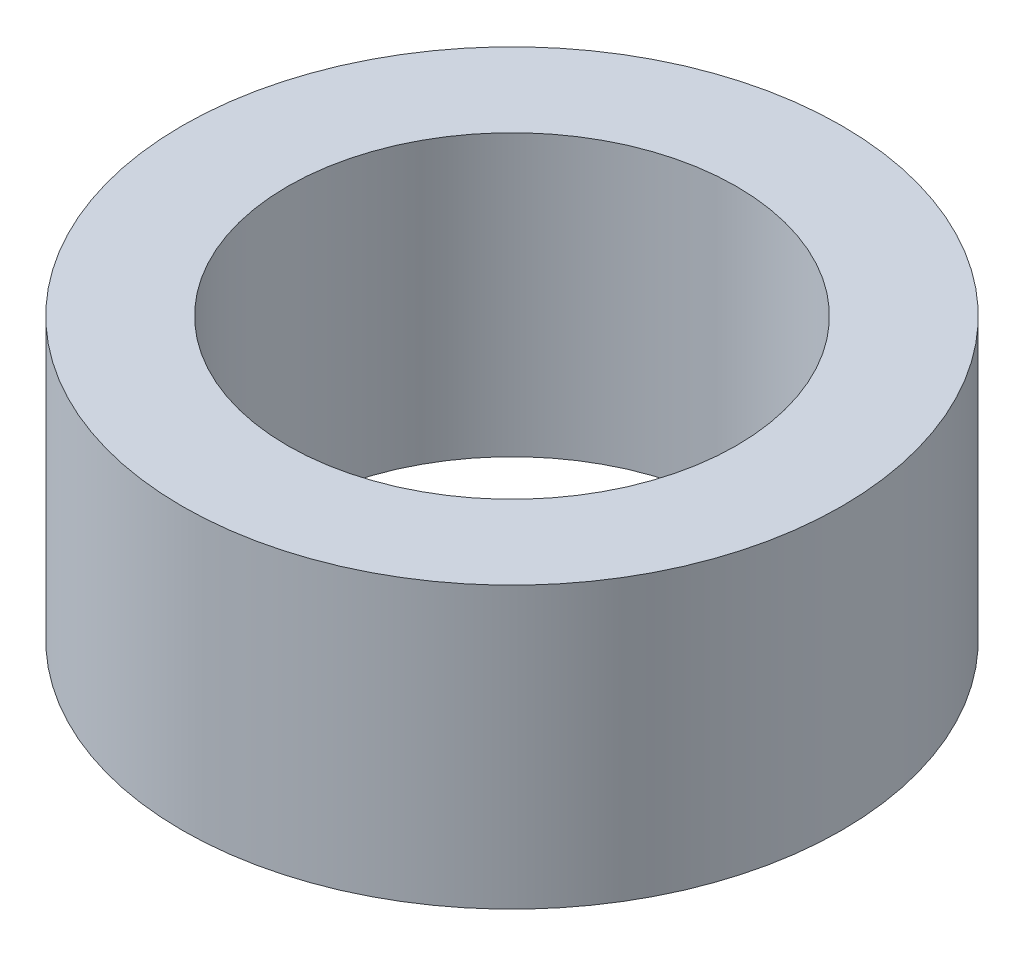
ISO-10303-21;
HEADER;
FILE_DESCRIPTION(('STEP AP214'),'2;1');
FILE_NAME('part.step','',(''),(''),'','','');
FILE_SCHEMA(('AUTOMOTIVE_DESIGN { 1 0 10303 214 1 1 1 1 }'));
ENDSEC;
DATA;
#1=APPLICATION_CONTEXT('core data for automotive mechanical design processes');
#2=APPLICATION_PROTOCOL_DEFINITION('international standard','automotive_design',2000,#1);
#3=PRODUCT_CONTEXT('',#1,'mechanical');
#4=PRODUCT('Part','Part','',(#3));
#5=PRODUCT_RELATED_PRODUCT_CATEGORY('part','',(#4));
#6=PRODUCT_DEFINITION_FORMATION('','',#4);
#7=PRODUCT_DEFINITION_CONTEXT('part definition',#1,'design');
#8=PRODUCT_DEFINITION('design','',#6,#7);
#9=PRODUCT_DEFINITION_SHAPE('','',#8);
#10=(LENGTH_UNIT() NAMED_UNIT(*) SI_UNIT(.MILLI.,.METRE.));
#11=(NAMED_UNIT(*) PLANE_ANGLE_UNIT() SI_UNIT($,.RADIAN.));
#12=(NAMED_UNIT(*) SI_UNIT($,.STERADIAN.) SOLID_ANGLE_UNIT());
#13=UNCERTAINTY_MEASURE_WITH_UNIT(LENGTH_MEASURE(1.E-05),#10,'distance_accuracy_value','');
#14=(GEOMETRIC_REPRESENTATION_CONTEXT(3) GLOBAL_UNCERTAINTY_ASSIGNED_CONTEXT((#13)) GLOBAL_UNIT_ASSIGNED_CONTEXT((#10,
#11,#12)) REPRESENTATION_CONTEXT('',''));
#15=CARTESIAN_POINT('',(0.,0.,0.));
#16=DIRECTION('',(0.,0.,1.));
#17=DIRECTION('',(1.,0.,0.));
#18=AXIS2_PLACEMENT_3D('',#15,#16,#17);
#19=CARTESIAN_POINT('',(0.,2.,0.));
#20=DIRECTION('',(0.,1.,0.));
#21=DIRECTION('',(0.,0.,1.));
#22=AXIS2_PLACEMENT_3D('',#19,#20,#21);
#23=PLANE('',#22);
#24=CARTESIAN_POINT('',(0.,2.,0.));
#25=DIRECTION('',(0.,1.,0.));
#26=DIRECTION('',(0.,0.,1.));
#27=AXIS2_PLACEMENT_3D('',#24,#25,#26);
#28=CIRCLE('',#27,2.35);
#29=CARTESIAN_POINT('',(0.,2.,2.35));
#30=VERTEX_POINT('',#29);
#31=EDGE_CURVE('E10',#30,#30,#28,.T.);
#32=ORIENTED_EDGE('',*,*,#31,.T.);
#33=EDGE_LOOP('',(#32));
#34=FACE_BOUND('',#33,.T.);
#35=CARTESIAN_POINT('',(0.,2.,0.));
#36=DIRECTION('',(0.,1.,0.));
#37=DIRECTION('',(0.,0.,1.));
#38=AXIS2_PLACEMENT_3D('',#35,#36,#37);
#39=CIRCLE('',#38,1.6);
#40=CARTESIAN_POINT('',(0.,2.,1.6));
#41=VERTEX_POINT('',#40);
#42=EDGE_CURVE('E50',#41,#41,#39,.T.);
#43=ORIENTED_EDGE('',*,*,#42,.F.);
#44=EDGE_LOOP('',(#43));
#45=FACE_BOUND('',#44,.T.);
#46=ADVANCED_FACE('F37',(#34,#45),#23,.T.);
#47=CARTESIAN_POINT('',(0.,0.,0.));
#48=DIRECTION('',(0.,1.,0.));
#49=DIRECTION('',(0.,0.,1.));
#50=AXIS2_PLACEMENT_3D('',#47,#48,#49);
#51=PLANE('',#50);
#52=CARTESIAN_POINT('',(0.,0.,0.));
#53=DIRECTION('',(0.,1.,0.));
#54=DIRECTION('',(0.,0.,1.));
#55=AXIS2_PLACEMENT_3D('',#52,#53,#54);
#56=CIRCLE('',#55,2.35);
#57=CARTESIAN_POINT('',(0.,0.,2.35));
#58=VERTEX_POINT('',#57);
#59=EDGE_CURVE('E41',#58,#58,#56,.T.);
#60=ORIENTED_EDGE('',*,*,#59,.F.);
#61=EDGE_LOOP('',(#60));
#62=FACE_BOUND('',#61,.T.);
#63=CARTESIAN_POINT('',(0.,0.,0.));
#64=DIRECTION('',(0.,1.,0.));
#65=DIRECTION('',(0.,0.,1.));
#66=AXIS2_PLACEMENT_3D('',#63,#64,#65);
#67=CIRCLE('',#66,1.6);
#68=CARTESIAN_POINT('',(0.,0.,1.6));
#69=VERTEX_POINT('',#68);
#70=EDGE_CURVE('E52',#69,#69,#67,.T.);
#71=ORIENTED_EDGE('',*,*,#70,.T.);
#72=EDGE_LOOP('',(#71));
#73=FACE_BOUND('',#72,.T.);
#74=ADVANCED_FACE('F64',(#62,#73),#51,.F.);
#75=CARTESIAN_POINT('',(0.,2.,0.));
#76=DIRECTION('',(0.,-1.,0.));
#77=DIRECTION('',(0.,0.,-1.));
#78=AXIS2_PLACEMENT_3D('',#75,#76,#77);
#79=CYLINDRICAL_SURFACE('',#78,2.35);
#80=ORIENTED_EDGE('',*,*,#31,.F.);
#81=EDGE_LOOP('',(#80));
#82=FACE_BOUND('',#81,.T.);
#83=ORIENTED_EDGE('',*,*,#59,.T.);
#84=EDGE_LOOP('',(#83));
#85=FACE_BOUND('',#84,.T.);
#86=ADVANCED_FACE('F39',(#82,#85),#79,.T.);
#87=CARTESIAN_POINT('',(0.,2.,0.));
#88=DIRECTION('',(0.,-1.,0.));
#89=DIRECTION('',(0.,0.,-1.));
#90=AXIS2_PLACEMENT_3D('',#87,#88,#89);
#91=CYLINDRICAL_SURFACE('',#90,1.6);
#92=ORIENTED_EDGE('',*,*,#42,.T.);
#93=EDGE_LOOP('',(#92));
#94=FACE_BOUND('',#93,.T.);
#95=ORIENTED_EDGE('',*,*,#70,.F.);
#96=EDGE_LOOP('',(#95));
#97=FACE_BOUND('',#96,.T.);
#98=ADVANCED_FACE('F60',(#94,#97),#91,.F.);
#99=CLOSED_SHELL('',(#46,#74,#86,#98));
#100=MANIFOLD_SOLID_BREP('B2',#99);
#101=ADVANCED_BREP_SHAPE_REPRESENTATION('',(#18,#100),#14);
#102=SHAPE_DEFINITION_REPRESENTATION(#9,#101);
ENDSEC;
END-ISO-10303-21;
